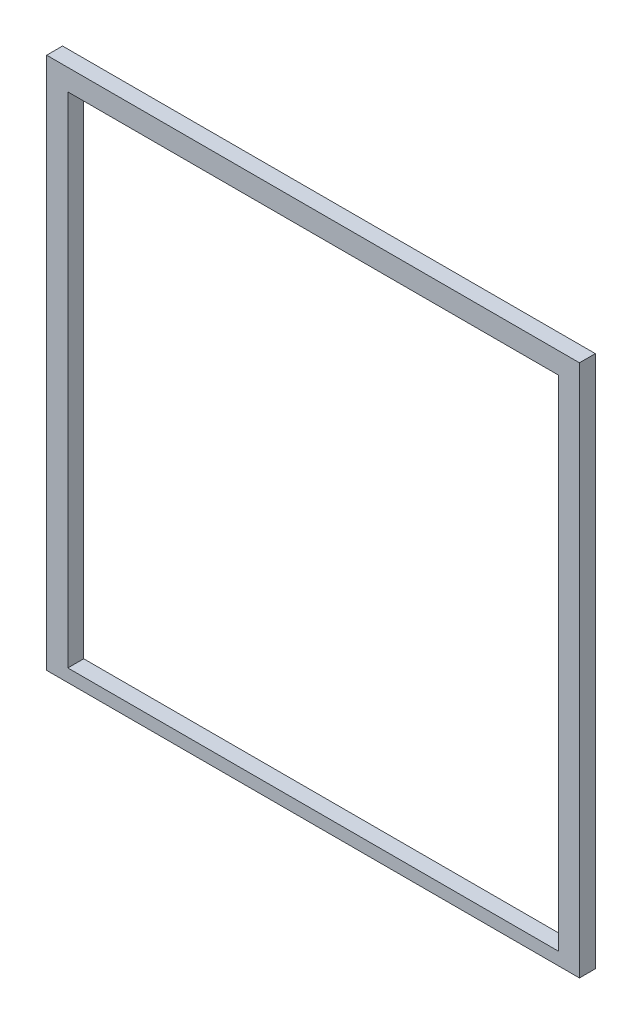
ISO-10303-21;
HEADER;
FILE_DESCRIPTION(('STEP AP214'),'2;1');
FILE_NAME('part.step','',(''),(''),'','','');
FILE_SCHEMA(('AUTOMOTIVE_DESIGN { 1 0 10303 214 1 1 1 1 }'));
ENDSEC;
DATA;
#1=APPLICATION_CONTEXT('core data for automotive mechanical design processes');
#2=APPLICATION_PROTOCOL_DEFINITION('international standard','automotive_design',2000,#1);
#3=PRODUCT_CONTEXT('',#1,'mechanical');
#4=PRODUCT('Part','Part','',(#3));
#5=PRODUCT_RELATED_PRODUCT_CATEGORY('part','',(#4));
#6=PRODUCT_DEFINITION_FORMATION('','',#4);
#7=PRODUCT_DEFINITION_CONTEXT('part definition',#1,'design');
#8=PRODUCT_DEFINITION('design','',#6,#7);
#9=PRODUCT_DEFINITION_SHAPE('','',#8);
#10=(LENGTH_UNIT() NAMED_UNIT(*) SI_UNIT(.MILLI.,.METRE.));
#11=(NAMED_UNIT(*) PLANE_ANGLE_UNIT() SI_UNIT($,.RADIAN.));
#12=(NAMED_UNIT(*) SI_UNIT($,.STERADIAN.) SOLID_ANGLE_UNIT());
#13=UNCERTAINTY_MEASURE_WITH_UNIT(LENGTH_MEASURE(1.E-05),#10,'distance_accuracy_value','');
#14=(GEOMETRIC_REPRESENTATION_CONTEXT(3) GLOBAL_UNCERTAINTY_ASSIGNED_CONTEXT((#13)) GLOBAL_UNIT_ASSIGNED_CONTEXT((#10,
#11,#12)) REPRESENTATION_CONTEXT('',''));
#15=CARTESIAN_POINT('',(0.,0.,0.));
#16=DIRECTION('',(0.,0.,1.));
#17=DIRECTION('',(1.,0.,0.));
#18=AXIS2_PLACEMENT_3D('',#15,#16,#17);
#19=CARTESIAN_POINT('',(0.,0.,15.));
#20=DIRECTION('',(0.,0.,-1.));
#21=DIRECTION('',(-1.,0.,0.));
#22=AXIS2_PLACEMENT_3D('',#19,#20,#21);
#23=PLANE('',#22);
#24=DIRECTION('',(0.,-1.,0.));
#25=VECTOR('',#24,1.);
#26=CARTESIAN_POINT('',(0.,0.,15.));
#27=LINE('',#26,#25);
#28=CARTESIAN_POINT('',(0.,503.,15.));
#29=VERTEX_POINT('',#28);
#30=CARTESIAN_POINT('',(0.,0.,15.));
#31=VERTEX_POINT('',#30);
#32=EDGE_CURVE('E134',#29,#31,#27,.T.);
#33=ORIENTED_EDGE('',*,*,#32,.T.);
#34=DIRECTION('',(1.,0.,0.));
#35=VECTOR('',#34,1.);
#36=CARTESIAN_POINT('',(0.,0.,15.));
#37=LINE('',#36,#35);
#38=CARTESIAN_POINT('',(503.,0.,15.));
#39=VERTEX_POINT('',#38);
#40=EDGE_CURVE('E137',#31,#39,#37,.T.);
#41=ORIENTED_EDGE('',*,*,#40,.T.);
#42=DIRECTION('',(0.,1.,0.));
#43=VECTOR('',#42,1.);
#44=CARTESIAN_POINT('',(503.,0.,15.));
#45=LINE('',#44,#43);
#46=CARTESIAN_POINT('',(503.,503.,15.));
#47=VERTEX_POINT('',#46);
#48=EDGE_CURVE('E140',#39,#47,#45,.T.);
#49=ORIENTED_EDGE('',*,*,#48,.T.);
#50=DIRECTION('',(-1.,0.,0.));
#51=VECTOR('',#50,1.);
#52=CARTESIAN_POINT('',(0.,503.,15.));
#53=LINE('',#52,#51);
#54=EDGE_CURVE('E142',#47,#29,#53,.T.);
#55=ORIENTED_EDGE('',*,*,#54,.T.);
#56=EDGE_LOOP('',(#33,#41,#49,#55));
#57=FACE_BOUND('',#56,.T.);
#58=DIRECTION('',(0.,-1.,0.));
#59=VECTOR('',#58,1.);
#60=CARTESIAN_POINT('',(20.,483.,15.));
#61=LINE('',#60,#59);
#62=CARTESIAN_POINT('',(20.,483.,15.));
#63=VERTEX_POINT('',#62);
#64=CARTESIAN_POINT('',(20.0000000000001,12.,15.));
#65=VERTEX_POINT('',#64);
#66=EDGE_CURVE('E98',#63,#65,#61,.T.);
#67=ORIENTED_EDGE('',*,*,#66,.F.);
#68=DIRECTION('',(-1.,0.,0.));
#69=VECTOR('',#68,1.);
#70=CARTESIAN_POINT('',(20.,483.,15.));
#71=LINE('',#70,#69);
#72=CARTESIAN_POINT('',(483.,483.,15.));
#73=VERTEX_POINT('',#72);
#74=EDGE_CURVE('E120',#73,#63,#71,.T.);
#75=ORIENTED_EDGE('',*,*,#74,.F.);
#76=DIRECTION('',(0.,1.,0.));
#77=VECTOR('',#76,1.);
#78=CARTESIAN_POINT('',(483.,483.,15.));
#79=LINE('',#78,#77);
#80=CARTESIAN_POINT('',(483.,12.,15.));
#81=VERTEX_POINT('',#80);
#82=EDGE_CURVE('E118',#81,#73,#79,.T.);
#83=ORIENTED_EDGE('',*,*,#82,.F.);
#84=DIRECTION('',(1.,0.,0.));
#85=VECTOR('',#84,1.);
#86=CARTESIAN_POINT('',(20.0000000000001,12.,15.));
#87=LINE('',#86,#85);
#88=EDGE_CURVE('E106',#65,#81,#87,.T.);
#89=ORIENTED_EDGE('',*,*,#88,.F.);
#90=EDGE_LOOP('',(#67,#75,#83,#89));
#91=FACE_BOUND('',#90,.T.);
#92=ADVANCED_FACE('F33',(#57,#91),#23,.F.);
#93=CARTESIAN_POINT('',(0.,0.,0.));
#94=DIRECTION('',(0.,0.,-1.));
#95=DIRECTION('',(-1.,0.,0.));
#96=AXIS2_PLACEMENT_3D('',#93,#94,#95);
#97=PLANE('',#96);
#98=DIRECTION('',(0.,-1.,0.));
#99=VECTOR('',#98,1.);
#100=CARTESIAN_POINT('',(0.,0.,0.));
#101=LINE('',#100,#99);
#102=CARTESIAN_POINT('',(0.,503.,0.));
#103=VERTEX_POINT('',#102);
#104=CARTESIAN_POINT('',(0.,0.,0.));
#105=VERTEX_POINT('',#104);
#106=EDGE_CURVE('E114',#103,#105,#101,.T.);
#107=ORIENTED_EDGE('',*,*,#106,.F.);
#108=DIRECTION('',(-1.,0.,0.));
#109=VECTOR('',#108,1.);
#110=CARTESIAN_POINT('',(0.,503.,0.));
#111=LINE('',#110,#109);
#112=CARTESIAN_POINT('',(503.,503.,0.));
#113=VERTEX_POINT('',#112);
#114=EDGE_CURVE('E138',#113,#103,#111,.T.);
#115=ORIENTED_EDGE('',*,*,#114,.F.);
#116=DIRECTION('',(0.,1.,0.));
#117=VECTOR('',#116,1.);
#118=CARTESIAN_POINT('',(503.,0.,0.));
#119=LINE('',#118,#117);
#120=CARTESIAN_POINT('',(503.,0.,0.));
#121=VERTEX_POINT('',#120);
#122=EDGE_CURVE('E149',#121,#113,#119,.T.);
#123=ORIENTED_EDGE('',*,*,#122,.F.);
#124=DIRECTION('',(1.,0.,0.));
#125=VECTOR('',#124,1.);
#126=CARTESIAN_POINT('',(0.,0.,0.));
#127=LINE('',#126,#125);
#128=EDGE_CURVE('E147',#105,#121,#127,.T.);
#129=ORIENTED_EDGE('',*,*,#128,.F.);
#130=EDGE_LOOP('',(#107,#115,#123,#129));
#131=FACE_BOUND('',#130,.T.);
#132=DIRECTION('',(-1.,0.,0.));
#133=VECTOR('',#132,1.);
#134=CARTESIAN_POINT('',(20.,483.,0.));
#135=LINE('',#134,#133);
#136=CARTESIAN_POINT('',(483.,483.,0.));
#137=VERTEX_POINT('',#136);
#138=CARTESIAN_POINT('',(20.,483.,0.));
#139=VERTEX_POINT('',#138);
#140=EDGE_CURVE('E107',#137,#139,#135,.T.);
#141=ORIENTED_EDGE('',*,*,#140,.T.);
#142=DIRECTION('',(0.,-1.,0.));
#143=VECTOR('',#142,1.);
#144=CARTESIAN_POINT('',(20.,483.,0.));
#145=LINE('',#144,#143);
#146=CARTESIAN_POINT('',(20.0000000000001,12.,0.));
#147=VERTEX_POINT('',#146);
#148=EDGE_CURVE('E56',#139,#147,#145,.T.);
#149=ORIENTED_EDGE('',*,*,#148,.T.);
#150=DIRECTION('',(1.,0.,0.));
#151=VECTOR('',#150,1.);
#152=CARTESIAN_POINT('',(20.0000000000001,12.,0.));
#153=LINE('',#152,#151);
#154=CARTESIAN_POINT('',(483.,12.,0.));
#155=VERTEX_POINT('',#154);
#156=EDGE_CURVE('E113',#147,#155,#153,.T.);
#157=ORIENTED_EDGE('',*,*,#156,.T.);
#158=DIRECTION('',(0.,1.,0.));
#159=VECTOR('',#158,1.);
#160=CARTESIAN_POINT('',(483.,483.,0.));
#161=LINE('',#160,#159);
#162=EDGE_CURVE('E126',#155,#137,#161,.T.);
#163=ORIENTED_EDGE('',*,*,#162,.T.);
#164=EDGE_LOOP('',(#141,#149,#157,#163));
#165=FACE_BOUND('',#164,.T.);
#166=ADVANCED_FACE('F167',(#131,#165),#97,.T.);
#167=CARTESIAN_POINT('',(0.,0.,15.));
#168=DIRECTION('',(1.,0.,0.));
#169=DIRECTION('',(0.,0.,-1.));
#170=AXIS2_PLACEMENT_3D('',#167,#168,#169);
#171=PLANE('',#170);
#172=ORIENTED_EDGE('',*,*,#106,.T.);
#173=DIRECTION('',(0.,0.,-1.));
#174=VECTOR('',#173,1.);
#175=CARTESIAN_POINT('',(0.,0.,15.));
#176=LINE('',#175,#174);
#177=EDGE_CURVE('E11',#31,#105,#176,.T.);
#178=ORIENTED_EDGE('',*,*,#177,.F.);
#179=ORIENTED_EDGE('',*,*,#32,.F.);
#180=DIRECTION('',(0.,0.,-1.));
#181=VECTOR('',#180,1.);
#182=CARTESIAN_POINT('',(0.,503.,15.));
#183=LINE('',#182,#181);
#184=EDGE_CURVE('E144',#29,#103,#183,.T.);
#185=ORIENTED_EDGE('',*,*,#184,.T.);
#186=EDGE_LOOP('',(#172,#178,#179,#185));
#187=FACE_BOUND('',#186,.T.);
#188=ADVANCED_FACE('F35',(#187),#171,.F.);
#189=CARTESIAN_POINT('',(0.,0.,15.));
#190=DIRECTION('',(0.,1.,0.));
#191=DIRECTION('',(0.,0.,1.));
#192=AXIS2_PLACEMENT_3D('',#189,#190,#191);
#193=PLANE('',#192);
#194=ORIENTED_EDGE('',*,*,#128,.T.);
#195=DIRECTION('',(0.,0.,-1.));
#196=VECTOR('',#195,1.);
#197=CARTESIAN_POINT('',(503.,0.,15.));
#198=LINE('',#197,#196);
#199=EDGE_CURVE('E41',#39,#121,#198,.T.);
#200=ORIENTED_EDGE('',*,*,#199,.F.);
#201=ORIENTED_EDGE('',*,*,#40,.F.);
#202=ORIENTED_EDGE('',*,*,#177,.T.);
#203=EDGE_LOOP('',(#194,#200,#201,#202));
#204=FACE_BOUND('',#203,.T.);
#205=ADVANCED_FACE('F177',(#204),#193,.F.);
#206=CARTESIAN_POINT('',(503.,0.,15.));
#207=DIRECTION('',(-1.,0.,0.));
#208=DIRECTION('',(0.,0.,1.));
#209=AXIS2_PLACEMENT_3D('',#206,#207,#208);
#210=PLANE('',#209);
#211=ORIENTED_EDGE('',*,*,#122,.T.);
#212=DIRECTION('',(0.,0.,-1.));
#213=VECTOR('',#212,1.);
#214=CARTESIAN_POINT('',(503.,503.,15.));
#215=LINE('',#214,#213);
#216=EDGE_CURVE('E154',#47,#113,#215,.T.);
#217=ORIENTED_EDGE('',*,*,#216,.F.);
#218=ORIENTED_EDGE('',*,*,#48,.F.);
#219=ORIENTED_EDGE('',*,*,#199,.T.);
#220=EDGE_LOOP('',(#211,#217,#218,#219));
#221=FACE_BOUND('',#220,.T.);
#222=ADVANCED_FACE('F161',(#221),#210,.F.);
#223=CARTESIAN_POINT('',(0.,503.,15.));
#224=DIRECTION('',(0.,-1.,0.));
#225=DIRECTION('',(0.,0.,-1.));
#226=AXIS2_PLACEMENT_3D('',#223,#224,#225);
#227=PLANE('',#226);
#228=ORIENTED_EDGE('',*,*,#114,.T.);
#229=ORIENTED_EDGE('',*,*,#184,.F.);
#230=ORIENTED_EDGE('',*,*,#54,.F.);
#231=ORIENTED_EDGE('',*,*,#216,.T.);
#232=EDGE_LOOP('',(#228,#229,#230,#231));
#233=FACE_BOUND('',#232,.T.);
#234=ADVANCED_FACE('F171',(#233),#227,.F.);
#235=CARTESIAN_POINT('',(20.,483.,15.));
#236=DIRECTION('',(1.,0.,0.));
#237=DIRECTION('',(0.,1.,0.));
#238=AXIS2_PLACEMENT_3D('',#235,#236,#237);
#239=PLANE('',#238);
#240=ORIENTED_EDGE('',*,*,#148,.F.);
#241=DIRECTION('',(0.,0.,-1.));
#242=VECTOR('',#241,1.);
#243=CARTESIAN_POINT('',(20.,483.,15.));
#244=LINE('',#243,#242);
#245=EDGE_CURVE('E102',#63,#139,#244,.T.);
#246=ORIENTED_EDGE('',*,*,#245,.F.);
#247=ORIENTED_EDGE('',*,*,#66,.T.);
#248=DIRECTION('',(0.,0.,-1.));
#249=VECTOR('',#248,1.);
#250=CARTESIAN_POINT('',(20.0000000000001,12.,15.));
#251=LINE('',#250,#249);
#252=EDGE_CURVE('E101',#65,#147,#251,.T.);
#253=ORIENTED_EDGE('',*,*,#252,.T.);
#254=EDGE_LOOP('',(#240,#246,#247,#253));
#255=FACE_BOUND('',#254,.T.);
#256=ADVANCED_FACE('F100',(#255),#239,.T.);
#257=CARTESIAN_POINT('',(20.0000000000001,12.,15.));
#258=DIRECTION('',(0.,1.,0.));
#259=DIRECTION('',(0.,0.,1.));
#260=AXIS2_PLACEMENT_3D('',#257,#258,#259);
#261=PLANE('',#260);
#262=ORIENTED_EDGE('',*,*,#156,.F.);
#263=ORIENTED_EDGE('',*,*,#252,.F.);
#264=ORIENTED_EDGE('',*,*,#88,.T.);
#265=DIRECTION('',(0.,0.,-1.));
#266=VECTOR('',#265,1.);
#267=CARTESIAN_POINT('',(483.,12.,15.));
#268=LINE('',#267,#266);
#269=EDGE_CURVE('E115',#81,#155,#268,.T.);
#270=ORIENTED_EDGE('',*,*,#269,.T.);
#271=EDGE_LOOP('',(#262,#263,#264,#270));
#272=FACE_BOUND('',#271,.T.);
#273=ADVANCED_FACE('F110',(#272),#261,.T.);
#274=CARTESIAN_POINT('',(483.,483.,15.));
#275=DIRECTION('',(-1.,0.,0.));
#276=DIRECTION('',(0.,-1.,0.));
#277=AXIS2_PLACEMENT_3D('',#274,#275,#276);
#278=PLANE('',#277);
#279=ORIENTED_EDGE('',*,*,#162,.F.);
#280=ORIENTED_EDGE('',*,*,#269,.F.);
#281=ORIENTED_EDGE('',*,*,#82,.T.);
#282=DIRECTION('',(0.,0.,-1.));
#283=VECTOR('',#282,1.);
#284=CARTESIAN_POINT('',(483.,483.,15.));
#285=LINE('',#284,#283);
#286=EDGE_CURVE('E48',#73,#137,#285,.T.);
#287=ORIENTED_EDGE('',*,*,#286,.T.);
#288=EDGE_LOOP('',(#279,#280,#281,#287));
#289=FACE_BOUND('',#288,.T.);
#290=ADVANCED_FACE('F200',(#289),#278,.T.);
#291=CARTESIAN_POINT('',(20.,483.,15.));
#292=DIRECTION('',(0.,-1.,0.));
#293=DIRECTION('',(0.,0.,-1.));
#294=AXIS2_PLACEMENT_3D('',#291,#292,#293);
#295=PLANE('',#294);
#296=ORIENTED_EDGE('',*,*,#140,.F.);
#297=ORIENTED_EDGE('',*,*,#286,.F.);
#298=ORIENTED_EDGE('',*,*,#74,.T.);
#299=ORIENTED_EDGE('',*,*,#245,.T.);
#300=EDGE_LOOP('',(#296,#297,#298,#299));
#301=FACE_BOUND('',#300,.T.);
#302=ADVANCED_FACE('F204',(#301),#295,.T.);
#303=CLOSED_SHELL('',(#92,#166,#188,#205,#222,#234,#256,#273,#290,#302));
#304=MANIFOLD_SOLID_BREP('B2',#303);
#305=ADVANCED_BREP_SHAPE_REPRESENTATION('',(#18,#304),#14);
#306=SHAPE_DEFINITION_REPRESENTATION(#9,#305);
ENDSEC;
END-ISO-10303-21;
